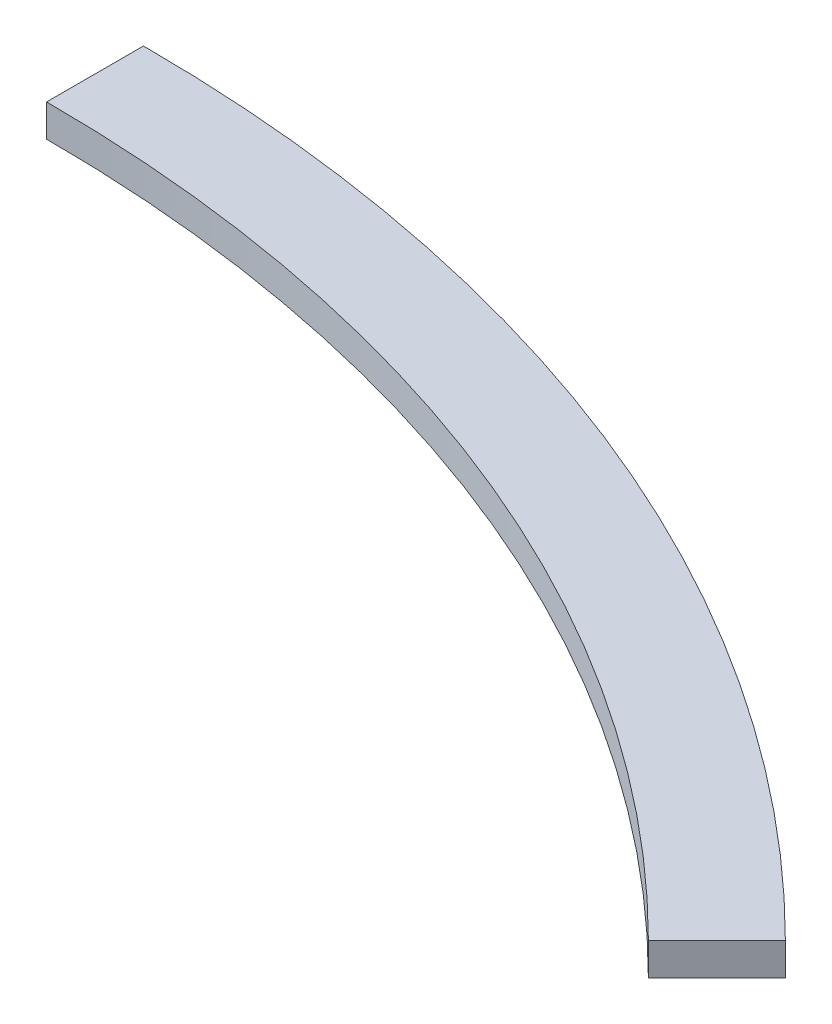
ISO-10303-21;
HEADER;
FILE_DESCRIPTION(('STEP AP214'),'2;1');
FILE_NAME('part.step','',(''),(''),'','','');
FILE_SCHEMA(('AUTOMOTIVE_DESIGN { 1 0 10303 214 1 1 1 1 }'));
ENDSEC;
DATA;
#1=APPLICATION_CONTEXT('core data for automotive mechanical design processes');
#2=APPLICATION_PROTOCOL_DEFINITION('international standard','automotive_design',2000,#1);
#3=PRODUCT_CONTEXT('',#1,'mechanical');
#4=PRODUCT('Part','Part','',(#3));
#5=PRODUCT_RELATED_PRODUCT_CATEGORY('part','',(#4));
#6=PRODUCT_DEFINITION_FORMATION('','',#4);
#7=PRODUCT_DEFINITION_CONTEXT('part definition',#1,'design');
#8=PRODUCT_DEFINITION('design','',#6,#7);
#9=PRODUCT_DEFINITION_SHAPE('','',#8);
#10=(LENGTH_UNIT() NAMED_UNIT(*) SI_UNIT(.MILLI.,.METRE.));
#11=(NAMED_UNIT(*) PLANE_ANGLE_UNIT() SI_UNIT($,.RADIAN.));
#12=(NAMED_UNIT(*) SI_UNIT($,.STERADIAN.) SOLID_ANGLE_UNIT());
#13=UNCERTAINTY_MEASURE_WITH_UNIT(LENGTH_MEASURE(1.E-05),#10,'distance_accuracy_value','');
#14=(GEOMETRIC_REPRESENTATION_CONTEXT(3) GLOBAL_UNCERTAINTY_ASSIGNED_CONTEXT((#13)) GLOBAL_UNIT_ASSIGNED_CONTEXT((#10,
#11,#12)) REPRESENTATION_CONTEXT('',''));
#15=CARTESIAN_POINT('',(0.,0.,0.));
#16=DIRECTION('',(0.,0.,1.));
#17=DIRECTION('',(1.,0.,0.));
#18=AXIS2_PLACEMENT_3D('',#15,#16,#17);
#19=CARTESIAN_POINT('',(0.,10.,0.));
#20=DIRECTION('',(0.,-1.,0.));
#21=DIRECTION('',(0.,0.,-1.));
#22=AXIS2_PLACEMENT_3D('',#19,#20,#21);
#23=CYLINDRICAL_SURFACE('',#22,480.);
#24=CARTESIAN_POINT('',(0.,0.,0.));
#25=DIRECTION('',(0.,1.,0.));
#26=DIRECTION('',(0.,0.,1.));
#27=AXIS2_PLACEMENT_3D('',#24,#25,#26);
#28=CIRCLE('',#27,480.);
#29=CARTESIAN_POINT('',(0.,0.,-480.));
#30=VERTEX_POINT('',#29);
#31=CARTESIAN_POINT('',(339.411254969543,0.,-339.411254969542));
#32=VERTEX_POINT('',#31);
#33=EDGE_CURVE('E95',#30,#32,#28,.F.);
#34=ORIENTED_EDGE('',*,*,#33,.F.);
#35=DIRECTION('',(0.,-1.,0.));
#36=VECTOR('',#35,1.);
#37=CARTESIAN_POINT('',(0.,10.,-480.));
#38=LINE('',#37,#36);
#39=CARTESIAN_POINT('',(0.,10.,-480.));
#40=VERTEX_POINT('',#39);
#41=EDGE_CURVE('E11',#40,#30,#38,.T.);
#42=ORIENTED_EDGE('',*,*,#41,.F.);
#43=CARTESIAN_POINT('',(0.,10.,0.));
#44=DIRECTION('',(0.,1.,0.));
#45=DIRECTION('',(0.,0.,1.));
#46=AXIS2_PLACEMENT_3D('',#43,#44,#45);
#47=CIRCLE('',#46,480.);
#48=CARTESIAN_POINT('',(339.411254969543,10.,-339.411254969542));
#49=VERTEX_POINT('',#48);
#50=EDGE_CURVE('E89',#40,#49,#47,.F.);
#51=ORIENTED_EDGE('',*,*,#50,.T.);
#52=DIRECTION('',(0.,-1.,0.));
#53=VECTOR('',#52,1.);
#54=CARTESIAN_POINT('',(339.411254969543,10.,-339.411254969542));
#55=LINE('',#54,#53);
#56=EDGE_CURVE('E70',#49,#32,#55,.T.);
#57=ORIENTED_EDGE('',*,*,#56,.T.);
#58=EDGE_LOOP('',(#34,#42,#51,#57));
#59=FACE_BOUND('',#58,.T.);
#60=ADVANCED_FACE('F32',(#59),#23,.T.);
#61=CARTESIAN_POINT('',(0.,10.,0.));
#62=DIRECTION('',(-1.,0.,0.));
#63=DIRECTION('',(0.,0.,1.));
#64=AXIS2_PLACEMENT_3D('',#61,#62,#63);
#65=PLANE('',#64);
#66=DIRECTION('',(0.,0.,-1.));
#67=VECTOR('',#66,1.);
#68=CARTESIAN_POINT('',(0.,0.,0.));
#69=LINE('',#68,#67);
#70=CARTESIAN_POINT('',(0.,0.,-450.));
#71=VERTEX_POINT('',#70);
#72=EDGE_CURVE('E83',#71,#30,#69,.T.);
#73=ORIENTED_EDGE('',*,*,#72,.F.);
#74=DIRECTION('',(0.,-1.,0.));
#75=VECTOR('',#74,1.);
#76=CARTESIAN_POINT('',(0.,10.,-450.));
#77=LINE('',#76,#75);
#78=CARTESIAN_POINT('',(0.,10.,-450.));
#79=VERTEX_POINT('',#78);
#80=EDGE_CURVE('E40',#79,#71,#77,.T.);
#81=ORIENTED_EDGE('',*,*,#80,.F.);
#82=DIRECTION('',(0.,0.,-1.));
#83=VECTOR('',#82,1.);
#84=CARTESIAN_POINT('',(0.,10.,0.));
#85=LINE('',#84,#83);
#86=EDGE_CURVE('E81',#79,#40,#85,.T.);
#87=ORIENTED_EDGE('',*,*,#86,.T.);
#88=ORIENTED_EDGE('',*,*,#41,.T.);
#89=EDGE_LOOP('',(#73,#81,#87,#88));
#90=FACE_BOUND('',#89,.T.);
#91=ADVANCED_FACE('F79',(#90),#65,.T.);
#92=CARTESIAN_POINT('',(0.,10.,0.));
#93=DIRECTION('',(0.,-1.,0.));
#94=DIRECTION('',(0.,0.,-1.));
#95=AXIS2_PLACEMENT_3D('',#92,#93,#94);
#96=CYLINDRICAL_SURFACE('',#95,450.);
#97=CARTESIAN_POINT('',(0.,0.,0.));
#98=DIRECTION('',(0.,1.,0.));
#99=DIRECTION('',(0.,0.,1.));
#100=AXIS2_PLACEMENT_3D('',#97,#98,#99);
#101=CIRCLE('',#100,450.);
#102=CARTESIAN_POINT('',(318.198051533947,0.,-318.198051533946));
#103=VERTEX_POINT('',#102);
#104=EDGE_CURVE('E63',#71,#103,#101,.F.);
#105=ORIENTED_EDGE('',*,*,#104,.T.);
#106=DIRECTION('',(0.,-1.,0.));
#107=VECTOR('',#106,1.);
#108=CARTESIAN_POINT('',(318.198051533947,10.,-318.198051533946));
#109=LINE('',#108,#107);
#110=CARTESIAN_POINT('',(318.198051533947,10.,-318.198051533946));
#111=VERTEX_POINT('',#110);
#112=EDGE_CURVE('E84',#111,#103,#109,.T.);
#113=ORIENTED_EDGE('',*,*,#112,.F.);
#114=CARTESIAN_POINT('',(0.,10.,0.));
#115=DIRECTION('',(0.,1.,0.));
#116=DIRECTION('',(0.,0.,1.));
#117=AXIS2_PLACEMENT_3D('',#114,#115,#116);
#118=CIRCLE('',#117,450.);
#119=EDGE_CURVE('E85',#79,#111,#118,.F.);
#120=ORIENTED_EDGE('',*,*,#119,.F.);
#121=ORIENTED_EDGE('',*,*,#80,.T.);
#122=EDGE_LOOP('',(#105,#113,#120,#121));
#123=FACE_BOUND('',#122,.T.);
#124=ADVANCED_FACE('F86',(#123),#96,.F.);
#125=CARTESIAN_POINT('',(0.,10.,0.));
#126=DIRECTION('',(-0.707106781186547,0.,-0.707106781186548));
#127=DIRECTION('',(-0.707106781186548,0.,0.707106781186547));
#128=AXIS2_PLACEMENT_3D('',#125,#126,#127);
#129=PLANE('',#128);
#130=DIRECTION('',(0.707106781186548,0.,-0.707106781186547));
#131=VECTOR('',#130,1.);
#132=CARTESIAN_POINT('',(0.,0.,0.));
#133=LINE('',#132,#131);
#134=EDGE_CURVE('E91',#103,#32,#133,.T.);
#135=ORIENTED_EDGE('',*,*,#134,.T.);
#136=ORIENTED_EDGE('',*,*,#56,.F.);
#137=DIRECTION('',(0.707106781186548,0.,-0.707106781186547));
#138=VECTOR('',#137,1.);
#139=CARTESIAN_POINT('',(0.,10.,0.));
#140=LINE('',#139,#138);
#141=EDGE_CURVE('E48',#111,#49,#140,.T.);
#142=ORIENTED_EDGE('',*,*,#141,.F.);
#143=ORIENTED_EDGE('',*,*,#112,.T.);
#144=EDGE_LOOP('',(#135,#136,#142,#143));
#145=FACE_BOUND('',#144,.T.);
#146=ADVANCED_FACE('F104',(#145),#129,.F.);
#147=CARTESIAN_POINT('',(0.,10.,0.));
#148=DIRECTION('',(0.,1.,0.));
#149=DIRECTION('',(0.,0.,1.));
#150=AXIS2_PLACEMENT_3D('',#147,#148,#149);
#151=PLANE('',#150);
#152=ORIENTED_EDGE('',*,*,#50,.F.);
#153=ORIENTED_EDGE('',*,*,#86,.F.);
#154=ORIENTED_EDGE('',*,*,#119,.T.);
#155=ORIENTED_EDGE('',*,*,#141,.T.);
#156=EDGE_LOOP('',(#152,#153,#154,#155));
#157=FACE_BOUND('',#156,.T.);
#158=ADVANCED_FACE('F88',(#157),#151,.T.);
#159=CARTESIAN_POINT('',(0.,0.,0.));
#160=DIRECTION('',(0.,1.,0.));
#161=DIRECTION('',(0.,0.,1.));
#162=AXIS2_PLACEMENT_3D('',#159,#160,#161);
#163=PLANE('',#162);
#164=ORIENTED_EDGE('',*,*,#33,.T.);
#165=ORIENTED_EDGE('',*,*,#134,.F.);
#166=ORIENTED_EDGE('',*,*,#104,.F.);
#167=ORIENTED_EDGE('',*,*,#72,.T.);
#168=EDGE_LOOP('',(#164,#165,#166,#167));
#169=FACE_BOUND('',#168,.T.);
#170=ADVANCED_FACE('F106',(#169),#163,.F.);
#171=CLOSED_SHELL('',(#60,#91,#124,#146,#158,#170));
#172=MANIFOLD_SOLID_BREP('B2',#171);
#173=ADVANCED_BREP_SHAPE_REPRESENTATION('',(#18,#172),#14);
#174=SHAPE_DEFINITION_REPRESENTATION(#9,#173);
ENDSEC;
END-ISO-10303-21;
